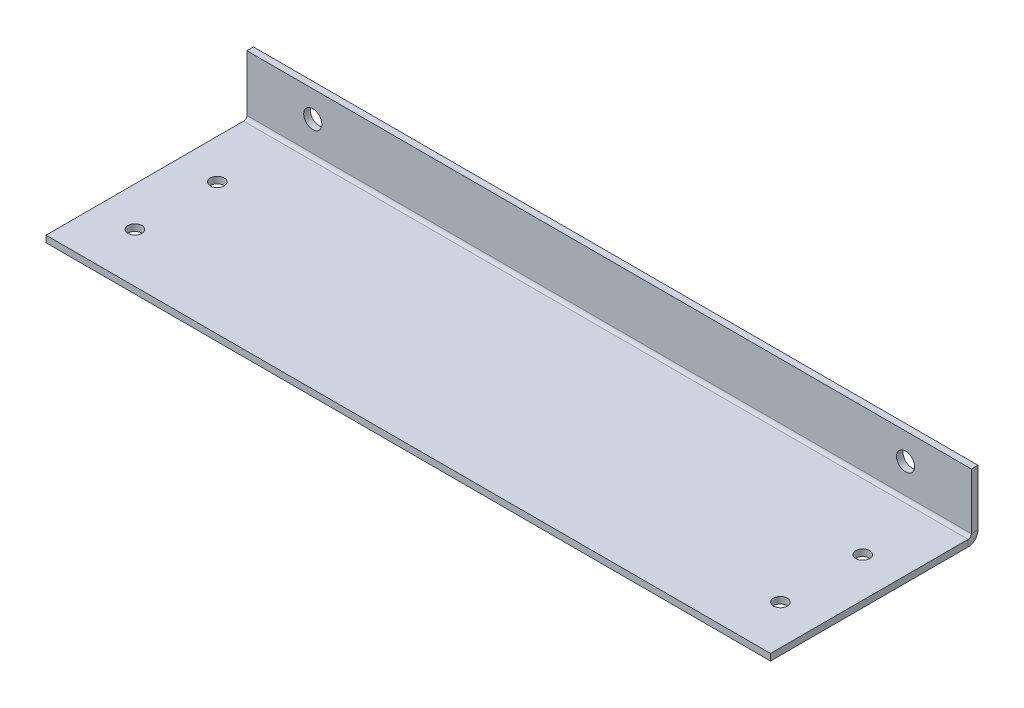
ISO-10303-21;
HEADER;
FILE_DESCRIPTION(('STEP AP214'),'2;1');
FILE_NAME('part.step','',(''),(''),'','','');
FILE_SCHEMA(('AUTOMOTIVE_DESIGN { 1 0 10303 214 1 1 1 1 }'));
ENDSEC;
DATA;
#1=APPLICATION_CONTEXT('core data for automotive mechanical design processes');
#2=APPLICATION_PROTOCOL_DEFINITION('international standard','automotive_design',2000,#1);
#3=PRODUCT_CONTEXT('',#1,'mechanical');
#4=PRODUCT('Part','Part','',(#3));
#5=PRODUCT_RELATED_PRODUCT_CATEGORY('part','',(#4));
#6=PRODUCT_DEFINITION_FORMATION('','',#4);
#7=PRODUCT_DEFINITION_CONTEXT('part definition',#1,'design');
#8=PRODUCT_DEFINITION('design','',#6,#7);
#9=PRODUCT_DEFINITION_SHAPE('','',#8);
#10=(LENGTH_UNIT() NAMED_UNIT(*) SI_UNIT(.MILLI.,.METRE.));
#11=(NAMED_UNIT(*) PLANE_ANGLE_UNIT() SI_UNIT($,.RADIAN.));
#12=(NAMED_UNIT(*) SI_UNIT($,.STERADIAN.) SOLID_ANGLE_UNIT());
#13=UNCERTAINTY_MEASURE_WITH_UNIT(LENGTH_MEASURE(1.E-05),#10,'distance_accuracy_value','');
#14=(GEOMETRIC_REPRESENTATION_CONTEXT(3) GLOBAL_UNCERTAINTY_ASSIGNED_CONTEXT((#13)) GLOBAL_UNIT_ASSIGNED_CONTEXT((#10,
#11,#12)) REPRESENTATION_CONTEXT('',''));
#15=CARTESIAN_POINT('',(0.,0.,0.));
#16=DIRECTION('',(0.,0.,1.));
#17=DIRECTION('',(1.,0.,0.));
#18=AXIS2_PLACEMENT_3D('',#15,#16,#17);
#19=CARTESIAN_POINT('',(-110.,-2.,-60.));
#20=DIRECTION('',(-1.,0.,0.));
#21=DIRECTION('',(0.,0.,1.));
#22=AXIS2_PLACEMENT_3D('',#19,#20,#21);
#23=PLANE('',#22);
#24=DIRECTION('',(0.,0.,1.));
#25=VECTOR('',#24,1.);
#26=CARTESIAN_POINT('',(-110.,0.,-60.));
#27=LINE('',#26,#25);
#28=CARTESIAN_POINT('',(-110.,0.,-60.));
#29=VERTEX_POINT('',#28);
#30=CARTESIAN_POINT('',(-110.,0.,0.));
#31=VERTEX_POINT('',#30);
#32=EDGE_CURVE('E101',#29,#31,#27,.T.);
#33=ORIENTED_EDGE('',*,*,#32,.F.);
#34=DIRECTION('',(0.,1.,0.));
#35=VECTOR('',#34,1.);
#36=CARTESIAN_POINT('',(-110.,-2.,-60.));
#37=LINE('',#36,#35);
#38=CARTESIAN_POINT('',(-110.,-2.00000000000004,-60.));
#39=VERTEX_POINT('',#38);
#40=EDGE_CURVE('E13',#39,#29,#37,.T.);
#41=ORIENTED_EDGE('',*,*,#40,.F.);
#42=DIRECTION('',(0.,0.,1.));
#43=VECTOR('',#42,1.);
#44=CARTESIAN_POINT('',(-110.,-2.,-60.));
#45=LINE('',#44,#43);
#46=CARTESIAN_POINT('',(-110.,-2.,0.));
#47=VERTEX_POINT('',#46);
#48=EDGE_CURVE('E206',#39,#47,#45,.T.);
#49=ORIENTED_EDGE('',*,*,#48,.T.);
#50=DIRECTION('',(0.,1.,0.));
#51=VECTOR('',#50,1.);
#52=CARTESIAN_POINT('',(-110.,-2.,0.));
#53=LINE('',#52,#51);
#54=EDGE_CURVE('E65',#47,#31,#53,.T.);
#55=ORIENTED_EDGE('',*,*,#54,.T.);
#56=EDGE_LOOP('',(#33,#41,#49,#55));
#57=FACE_BOUND('',#56,.T.);
#58=ADVANCED_FACE('F62',(#57),#23,.T.);
#59=CARTESIAN_POINT('',(110.,-2.,-60.));
#60=DIRECTION('',(1.,0.,0.));
#61=DIRECTION('',(0.,0.,-1.));
#62=AXIS2_PLACEMENT_3D('',#59,#60,#61);
#63=PLANE('',#62);
#64=DIRECTION('',(0.,0.,-1.));
#65=VECTOR('',#64,1.);
#66=CARTESIAN_POINT('',(110.,0.,-60.));
#67=LINE('',#66,#65);
#68=CARTESIAN_POINT('',(110.,0.,0.));
#69=VERTEX_POINT('',#68);
#70=CARTESIAN_POINT('',(110.,0.,-60.));
#71=VERTEX_POINT('',#70);
#72=EDGE_CURVE('E226',#69,#71,#67,.T.);
#73=ORIENTED_EDGE('',*,*,#72,.F.);
#74=DIRECTION('',(0.,1.,0.));
#75=VECTOR('',#74,1.);
#76=CARTESIAN_POINT('',(110.,-2.,0.));
#77=LINE('',#76,#75);
#78=CARTESIAN_POINT('',(110.,-2.,0.));
#79=VERTEX_POINT('',#78);
#80=EDGE_CURVE('E232',#79,#69,#77,.T.);
#81=ORIENTED_EDGE('',*,*,#80,.F.);
#82=DIRECTION('',(0.,0.,-1.));
#83=VECTOR('',#82,1.);
#84=CARTESIAN_POINT('',(110.,-2.,-60.));
#85=LINE('',#84,#83);
#86=CARTESIAN_POINT('',(110.,-2.,-60.));
#87=VERTEX_POINT('',#86);
#88=EDGE_CURVE('E81',#79,#87,#85,.T.);
#89=ORIENTED_EDGE('',*,*,#88,.T.);
#90=DIRECTION('',(0.,1.,0.));
#91=VECTOR('',#90,1.);
#92=CARTESIAN_POINT('',(110.,-2.,-60.));
#93=LINE('',#92,#91);
#94=EDGE_CURVE('E72',#87,#71,#93,.T.);
#95=ORIENTED_EDGE('',*,*,#94,.T.);
#96=EDGE_LOOP('',(#73,#81,#89,#95));
#97=FACE_BOUND('',#96,.T.);
#98=ADVANCED_FACE('F343',(#97),#63,.T.);
#99=CARTESIAN_POINT('',(-110.,-2.,0.));
#100=DIRECTION('',(0.,0.,1.));
#101=DIRECTION('',(1.,0.,0.));
#102=AXIS2_PLACEMENT_3D('',#99,#100,#101);
#103=PLANE('',#102);
#104=DIRECTION('',(1.,0.,0.));
#105=VECTOR('',#104,1.);
#106=CARTESIAN_POINT('',(-110.,0.,0.));
#107=LINE('',#106,#105);
#108=EDGE_CURVE('E222',#31,#69,#107,.T.);
#109=ORIENTED_EDGE('',*,*,#108,.F.);
#110=ORIENTED_EDGE('',*,*,#54,.F.);
#111=DIRECTION('',(1.,0.,0.));
#112=VECTOR('',#111,1.);
#113=CARTESIAN_POINT('',(-110.,-2.,0.));
#114=LINE('',#113,#112);
#115=EDGE_CURVE('E210',#47,#79,#114,.T.);
#116=ORIENTED_EDGE('',*,*,#115,.T.);
#117=ORIENTED_EDGE('',*,*,#80,.T.);
#118=EDGE_LOOP('',(#109,#110,#116,#117));
#119=FACE_BOUND('',#118,.T.);
#120=ADVANCED_FACE('F235',(#119),#103,.T.);
#121=CARTESIAN_POINT('',(0.,-2.,0.));
#122=DIRECTION('',(0.,1.,0.));
#123=DIRECTION('',(0.,0.,1.));
#124=AXIS2_PLACEMENT_3D('',#121,#122,#123);
#125=PLANE('',#124);
#126=CARTESIAN_POINT('',(98.,-2.,-40.));
#127=DIRECTION('',(0.,1.,0.));
#128=DIRECTION('',(0.,0.,1.));
#129=AXIS2_PLACEMENT_3D('',#126,#127,#128);
#130=CIRCLE('',#129,2.1);
#131=CARTESIAN_POINT('',(98.,-2.,-37.9));
#132=VERTEX_POINT('',#131);
#133=EDGE_CURVE('E294',#132,#132,#130,.T.);
#134=ORIENTED_EDGE('',*,*,#133,.T.);
#135=EDGE_LOOP('',(#134));
#136=FACE_BOUND('',#135,.T.);
#137=CARTESIAN_POINT('',(98.,-2.,-15.));
#138=DIRECTION('',(0.,1.,0.));
#139=DIRECTION('',(0.,0.,1.));
#140=AXIS2_PLACEMENT_3D('',#137,#138,#139);
#141=CIRCLE('',#140,2.1);
#142=CARTESIAN_POINT('',(98.,-2.,-12.9));
#143=VERTEX_POINT('',#142);
#144=EDGE_CURVE('E286',#143,#143,#141,.T.);
#145=ORIENTED_EDGE('',*,*,#144,.T.);
#146=EDGE_LOOP('',(#145));
#147=FACE_BOUND('',#146,.T.);
#148=CARTESIAN_POINT('',(-98.,-2.,-40.));
#149=DIRECTION('',(0.,1.,0.));
#150=DIRECTION('',(0.,0.,1.));
#151=AXIS2_PLACEMENT_3D('',#148,#149,#150);
#152=CIRCLE('',#151,2.1);
#153=CARTESIAN_POINT('',(-98.,-2.,-37.9));
#154=VERTEX_POINT('',#153);
#155=EDGE_CURVE('E278',#154,#154,#152,.T.);
#156=ORIENTED_EDGE('',*,*,#155,.T.);
#157=EDGE_LOOP('',(#156));
#158=FACE_BOUND('',#157,.T.);
#159=CARTESIAN_POINT('',(-98.,-2.,-15.));
#160=DIRECTION('',(0.,1.,0.));
#161=DIRECTION('',(0.,0.,1.));
#162=AXIS2_PLACEMENT_3D('',#159,#160,#161);
#163=CIRCLE('',#162,2.1);
#164=CARTESIAN_POINT('',(-98.,-2.,-12.9));
#165=VERTEX_POINT('',#164);
#166=EDGE_CURVE('E270',#165,#165,#163,.T.);
#167=ORIENTED_EDGE('',*,*,#166,.T.);
#168=EDGE_LOOP('',(#167));
#169=FACE_BOUND('',#168,.T.);
#170=ORIENTED_EDGE('',*,*,#48,.F.);
#171=DIRECTION('',(-1.,0.,0.));
#172=VECTOR('',#171,1.);
#173=CARTESIAN_POINT('',(-110.,-2.,-60.));
#174=LINE('',#173,#172);
#175=EDGE_CURVE('E216',#87,#39,#174,.T.);
#176=ORIENTED_EDGE('',*,*,#175,.F.);
#177=ORIENTED_EDGE('',*,*,#88,.F.);
#178=ORIENTED_EDGE('',*,*,#115,.F.);
#179=EDGE_LOOP('',(#170,#176,#177,#178));
#180=FACE_BOUND('',#179,.T.);
#181=ADVANCED_FACE('F309',(#136,#147,#158,#169,#180),#125,.F.);
#182=CARTESIAN_POINT('',(0.,0.,0.));
#183=DIRECTION('',(0.,1.,0.));
#184=DIRECTION('',(0.,0.,1.));
#185=AXIS2_PLACEMENT_3D('',#182,#183,#184);
#186=PLANE('',#185);
#187=CARTESIAN_POINT('',(98.,0.,-40.));
#188=DIRECTION('',(0.,1.,0.));
#189=DIRECTION('',(0.,0.,1.));
#190=AXIS2_PLACEMENT_3D('',#187,#188,#189);
#191=CIRCLE('',#190,2.1);
#192=CARTESIAN_POINT('',(98.,0.,-37.9));
#193=VERTEX_POINT('',#192);
#194=EDGE_CURVE('E298',#193,#193,#191,.T.);
#195=ORIENTED_EDGE('',*,*,#194,.F.);
#196=EDGE_LOOP('',(#195));
#197=FACE_BOUND('',#196,.T.);
#198=CARTESIAN_POINT('',(98.,0.,-15.));
#199=DIRECTION('',(0.,1.,0.));
#200=DIRECTION('',(0.,0.,1.));
#201=AXIS2_PLACEMENT_3D('',#198,#199,#200);
#202=CIRCLE('',#201,2.1);
#203=CARTESIAN_POINT('',(98.,0.,-12.9));
#204=VERTEX_POINT('',#203);
#205=EDGE_CURVE('E290',#204,#204,#202,.T.);
#206=ORIENTED_EDGE('',*,*,#205,.F.);
#207=EDGE_LOOP('',(#206));
#208=FACE_BOUND('',#207,.T.);
#209=CARTESIAN_POINT('',(-98.,0.,-40.));
#210=DIRECTION('',(0.,1.,0.));
#211=DIRECTION('',(0.,0.,1.));
#212=AXIS2_PLACEMENT_3D('',#209,#210,#211);
#213=CIRCLE('',#212,2.1);
#214=CARTESIAN_POINT('',(-98.,0.,-37.9));
#215=VERTEX_POINT('',#214);
#216=EDGE_CURVE('E282',#215,#215,#213,.T.);
#217=ORIENTED_EDGE('',*,*,#216,.F.);
#218=EDGE_LOOP('',(#217));
#219=FACE_BOUND('',#218,.T.);
#220=CARTESIAN_POINT('',(-98.,0.,-15.));
#221=DIRECTION('',(0.,1.,0.));
#222=DIRECTION('',(0.,0.,1.));
#223=AXIS2_PLACEMENT_3D('',#220,#221,#222);
#224=CIRCLE('',#223,2.1);
#225=CARTESIAN_POINT('',(-98.,0.,-12.9));
#226=VERTEX_POINT('',#225);
#227=EDGE_CURVE('E274',#226,#226,#224,.T.);
#228=ORIENTED_EDGE('',*,*,#227,.F.);
#229=EDGE_LOOP('',(#228));
#230=FACE_BOUND('',#229,.T.);
#231=ORIENTED_EDGE('',*,*,#32,.T.);
#232=ORIENTED_EDGE('',*,*,#108,.T.);
#233=ORIENTED_EDGE('',*,*,#72,.T.);
#234=DIRECTION('',(-1.,0.,0.));
#235=VECTOR('',#234,1.);
#236=CARTESIAN_POINT('',(-110.,0.,-60.));
#237=LINE('',#236,#235);
#238=EDGE_CURVE('E211',#71,#29,#237,.T.);
#239=ORIENTED_EDGE('',*,*,#238,.T.);
#240=EDGE_LOOP('',(#231,#232,#233,#239));
#241=FACE_BOUND('',#240,.T.);
#242=ADVANCED_FACE('F237',(#197,#208,#219,#230,#241),#186,.T.);
#243=CARTESIAN_POINT('',(110.,0.999999999999984,-60.));
#244=DIRECTION('',(1.,0.,0.));
#245=DIRECTION('',(0.,0.,-1.));
#246=AXIS2_PLACEMENT_3D('',#243,#244,#245);
#247=PLANE('',#246);
#248=DIRECTION('',(0.,0.,1.));
#249=VECTOR('',#248,1.);
#250=CARTESIAN_POINT('',(110.,1.00000000000001,-63.));
#251=LINE('',#250,#249);
#252=CARTESIAN_POINT('',(110.,0.99999999999998,-61.));
#253=VERTEX_POINT('',#252);
#254=CARTESIAN_POINT('',(110.,0.999999999999973,-63.));
#255=VERTEX_POINT('',#254);
#256=EDGE_CURVE('E163',#253,#255,#251,.F.);
#257=ORIENTED_EDGE('',*,*,#256,.F.);
#258=CARTESIAN_POINT('',(110.,0.999999999999984,-60.));
#259=DIRECTION('',(-1.,0.,0.));
#260=DIRECTION('',(0.,0.,1.));
#261=AXIS2_PLACEMENT_3D('',#258,#259,#260);
#262=CIRCLE('',#261,1.00000000000002);
#263=EDGE_CURVE('E198',#71,#253,#262,.F.);
#264=ORIENTED_EDGE('',*,*,#263,.F.);
#265=ORIENTED_EDGE('',*,*,#94,.F.);
#266=CARTESIAN_POINT('',(110.,0.999999999999984,-60.));
#267=DIRECTION('',(-1.,0.,0.));
#268=DIRECTION('',(0.,0.,1.));
#269=AXIS2_PLACEMENT_3D('',#266,#267,#268);
#270=CIRCLE('',#269,3.00000000000002);
#271=EDGE_CURVE('E190',#87,#255,#270,.F.);
#272=ORIENTED_EDGE('',*,*,#271,.T.);
#273=EDGE_LOOP('',(#257,#264,#265,#272));
#274=FACE_BOUND('',#273,.T.);
#275=ADVANCED_FACE('F308',(#274),#247,.T.);
#276=CARTESIAN_POINT('',(-110.,0.999999999999984,-60.));
#277=DIRECTION('',(1.,0.,0.));
#278=DIRECTION('',(0.,0.,-1.));
#279=AXIS2_PLACEMENT_3D('',#276,#277,#278);
#280=PLANE('',#279);
#281=CARTESIAN_POINT('',(-110.,0.999999999999984,-60.));
#282=DIRECTION('',(-1.,0.,0.));
#283=DIRECTION('',(0.,0.,1.));
#284=AXIS2_PLACEMENT_3D('',#281,#282,#283);
#285=CIRCLE('',#284,1.00000000000002);
#286=CARTESIAN_POINT('',(-110.,0.99999999999998,-61.));
#287=VERTEX_POINT('',#286);
#288=EDGE_CURVE('E202',#287,#29,#285,.T.);
#289=ORIENTED_EDGE('',*,*,#288,.F.);
#290=DIRECTION('',(0.,0.,1.));
#291=VECTOR('',#290,1.);
#292=CARTESIAN_POINT('',(-110.,0.999999999999987,-61.));
#293=LINE('',#292,#291);
#294=CARTESIAN_POINT('',(-110.,1.,-63.));
#295=VERTEX_POINT('',#294);
#296=EDGE_CURVE('E180',#287,#295,#293,.F.);
#297=ORIENTED_EDGE('',*,*,#296,.T.);
#298=CARTESIAN_POINT('',(-110.,0.999999999999984,-60.));
#299=DIRECTION('',(-1.,0.,0.));
#300=DIRECTION('',(0.,0.,1.));
#301=AXIS2_PLACEMENT_3D('',#298,#299,#300);
#302=CIRCLE('',#301,3.00000000000002);
#303=EDGE_CURVE('E194',#295,#39,#302,.T.);
#304=ORIENTED_EDGE('',*,*,#303,.T.);
#305=ORIENTED_EDGE('',*,*,#40,.T.);
#306=EDGE_LOOP('',(#289,#297,#304,#305));
#307=FACE_BOUND('',#306,.T.);
#308=ADVANCED_FACE('F243',(#307),#280,.F.);
#309=CARTESIAN_POINT('',(-110.,0.999999999999984,-60.));
#310=DIRECTION('',(-1.,0.,0.));
#311=DIRECTION('',(0.,0.,-1.));
#312=AXIS2_PLACEMENT_3D('',#309,#310,#311);
#313=CYLINDRICAL_SURFACE('',#312,3.00000000000002);
#314=ORIENTED_EDGE('',*,*,#175,.T.);
#315=ORIENTED_EDGE('',*,*,#303,.F.);
#316=DIRECTION('',(-1.,0.,0.));
#317=VECTOR('',#316,1.);
#318=CARTESIAN_POINT('',(110.,1.00000000000001,-63.));
#319=LINE('',#318,#317);
#320=EDGE_CURVE('E177',#295,#255,#319,.F.);
#321=ORIENTED_EDGE('',*,*,#320,.T.);
#322=ORIENTED_EDGE('',*,*,#271,.F.);
#323=EDGE_LOOP('',(#314,#315,#321,#322));
#324=FACE_BOUND('',#323,.T.);
#325=ADVANCED_FACE('F332',(#324),#313,.T.);
#326=CARTESIAN_POINT('',(-110.,0.999999999999984,-60.));
#327=DIRECTION('',(-1.,0.,0.));
#328=DIRECTION('',(0.,0.,-1.));
#329=AXIS2_PLACEMENT_3D('',#326,#327,#328);
#330=CYLINDRICAL_SURFACE('',#329,1.00000000000002);
#331=ORIENTED_EDGE('',*,*,#238,.F.);
#332=ORIENTED_EDGE('',*,*,#263,.T.);
#333=DIRECTION('',(-1.,0.,0.));
#334=VECTOR('',#333,1.);
#335=CARTESIAN_POINT('',(110.,0.999999999999994,-61.));
#336=LINE('',#335,#334);
#337=EDGE_CURVE('E184',#253,#287,#336,.T.);
#338=ORIENTED_EDGE('',*,*,#337,.T.);
#339=ORIENTED_EDGE('',*,*,#288,.T.);
#340=EDGE_LOOP('',(#331,#332,#338,#339));
#341=FACE_BOUND('',#340,.T.);
#342=ADVANCED_FACE('F245',(#341),#330,.F.);
#343=CARTESIAN_POINT('',(110.,0.,-63.));
#344=DIRECTION('',(-1.,0.,0.));
#345=DIRECTION('',(0.,0.,1.));
#346=AXIS2_PLACEMENT_3D('',#343,#344,#345);
#347=PLANE('',#346);
#348=ORIENTED_EDGE('',*,*,#256,.T.);
#349=DIRECTION('',(0.,-1.,0.));
#350=VECTOR('',#349,1.);
#351=CARTESIAN_POINT('',(110.,-2.15149779794903E-13,-63.));
#352=LINE('',#351,#350);
#353=CARTESIAN_POINT('',(110.,18.,-63.0000000000001));
#354=VERTEX_POINT('',#353);
#355=EDGE_CURVE('E142',#354,#255,#352,.T.);
#356=ORIENTED_EDGE('',*,*,#355,.F.);
#357=DIRECTION('',(0.,0.,1.));
#358=VECTOR('',#357,1.);
#359=CARTESIAN_POINT('',(110.,18.,-63.0000000000001));
#360=LINE('',#359,#358);
#361=CARTESIAN_POINT('',(110.,18.,-61.0000000000001));
#362=VERTEX_POINT('',#361);
#363=EDGE_CURVE('E149',#354,#362,#360,.T.);
#364=ORIENTED_EDGE('',*,*,#363,.T.);
#365=DIRECTION('',(0.,1.,0.));
#366=VECTOR('',#365,1.);
#367=CARTESIAN_POINT('',(110.,0.,-61.));
#368=LINE('',#367,#366);
#369=EDGE_CURVE('E174',#362,#253,#368,.F.);
#370=ORIENTED_EDGE('',*,*,#369,.T.);
#371=EDGE_LOOP('',(#348,#356,#364,#370));
#372=FACE_BOUND('',#371,.T.);
#373=ADVANCED_FACE('F162',(#372),#347,.F.);
#374=CARTESIAN_POINT('',(-110.,18.,-63.0000000000001));
#375=DIRECTION('',(1.,0.,0.));
#376=DIRECTION('',(0.,0.,-1.));
#377=AXIS2_PLACEMENT_3D('',#374,#375,#376);
#378=PLANE('',#377);
#379=ORIENTED_EDGE('',*,*,#296,.F.);
#380=DIRECTION('',(0.,-1.,0.));
#381=VECTOR('',#380,1.);
#382=CARTESIAN_POINT('',(-110.,18.,-61.0000000000001));
#383=LINE('',#382,#381);
#384=CARTESIAN_POINT('',(-110.,18.,-61.0000000000001));
#385=VERTEX_POINT('',#384);
#386=EDGE_CURVE('E169',#287,#385,#383,.F.);
#387=ORIENTED_EDGE('',*,*,#386,.T.);
#388=DIRECTION('',(0.,0.,1.));
#389=VECTOR('',#388,1.);
#390=CARTESIAN_POINT('',(-110.,18.,-63.0000000000001));
#391=LINE('',#390,#389);
#392=CARTESIAN_POINT('',(-110.,18.,-63.0000000000001));
#393=VERTEX_POINT('',#392);
#394=EDGE_CURVE('E159',#393,#385,#391,.T.);
#395=ORIENTED_EDGE('',*,*,#394,.F.);
#396=DIRECTION('',(0.,1.,0.));
#397=VECTOR('',#396,1.);
#398=CARTESIAN_POINT('',(-110.,-2.15149779794903E-13,-63.));
#399=LINE('',#398,#397);
#400=EDGE_CURVE('E144',#295,#393,#399,.T.);
#401=ORIENTED_EDGE('',*,*,#400,.F.);
#402=EDGE_LOOP('',(#379,#387,#395,#401));
#403=FACE_BOUND('',#402,.T.);
#404=ADVANCED_FACE('F251',(#403),#378,.F.);
#405=CARTESIAN_POINT('',(0.,-2.15149779794903E-13,-63.));
#406=DIRECTION('',(0.,0.,1.));
#407=DIRECTION('',(0.,-1.,0.));
#408=AXIS2_PLACEMENT_3D('',#405,#406,#407);
#409=PLANE('',#408);
#410=CARTESIAN_POINT('',(90.,10.,-63.0000000000001));
#411=DIRECTION('',(0.,0.,1.));
#412=DIRECTION('',(0.,-1.,0.));
#413=AXIS2_PLACEMENT_3D('',#410,#411,#412);
#414=CIRCLE('',#413,2.75);
#415=CARTESIAN_POINT('',(90.,7.25,-63.0000000000001));
#416=VERTEX_POINT('',#415);
#417=EDGE_CURVE('E262',#416,#416,#414,.T.);
#418=ORIENTED_EDGE('',*,*,#417,.T.);
#419=EDGE_LOOP('',(#418));
#420=FACE_BOUND('',#419,.T.);
#421=CARTESIAN_POINT('',(-90.,10.,-63.));
#422=DIRECTION('',(0.,0.,1.));
#423=DIRECTION('',(0.,-1.,0.));
#424=AXIS2_PLACEMENT_3D('',#421,#422,#423);
#425=CIRCLE('',#424,2.75);
#426=CARTESIAN_POINT('',(-90.,7.25,-63.));
#427=VERTEX_POINT('',#426);
#428=EDGE_CURVE('E189',#427,#427,#425,.T.);
#429=ORIENTED_EDGE('',*,*,#428,.T.);
#430=EDGE_LOOP('',(#429));
#431=FACE_BOUND('',#430,.T.);
#432=ORIENTED_EDGE('',*,*,#320,.F.);
#433=ORIENTED_EDGE('',*,*,#400,.T.);
#434=DIRECTION('',(1.,0.,0.));
#435=VECTOR('',#434,1.);
#436=CARTESIAN_POINT('',(0.,18.,-63.0000000000001));
#437=LINE('',#436,#435);
#438=EDGE_CURVE('E137',#393,#354,#437,.T.);
#439=ORIENTED_EDGE('',*,*,#438,.T.);
#440=ORIENTED_EDGE('',*,*,#355,.T.);
#441=EDGE_LOOP('',(#432,#433,#439,#440));
#442=FACE_BOUND('',#441,.T.);
#443=ADVANCED_FACE('F140',(#420,#431,#442),#409,.F.);
#444=CARTESIAN_POINT('',(0.,-2.08166817117217E-13,-61.));
#445=DIRECTION('',(0.,0.,1.));
#446=DIRECTION('',(0.,-1.,0.));
#447=AXIS2_PLACEMENT_3D('',#444,#445,#446);
#448=PLANE('',#447);
#449=CARTESIAN_POINT('',(90.,10.,-61.));
#450=DIRECTION('',(0.,0.,1.));
#451=DIRECTION('',(0.,-1.,0.));
#452=AXIS2_PLACEMENT_3D('',#449,#450,#451);
#453=CIRCLE('',#452,2.75);
#454=CARTESIAN_POINT('',(90.,7.25000000000001,-61.));
#455=VERTEX_POINT('',#454);
#456=EDGE_CURVE('E266',#455,#455,#453,.T.);
#457=ORIENTED_EDGE('',*,*,#456,.F.);
#458=EDGE_LOOP('',(#457));
#459=FACE_BOUND('',#458,.T.);
#460=CARTESIAN_POINT('',(-90.,10.,-61.));
#461=DIRECTION('',(0.,0.,1.));
#462=DIRECTION('',(0.,-1.,0.));
#463=AXIS2_PLACEMENT_3D('',#460,#461,#462);
#464=CIRCLE('',#463,2.75);
#465=CARTESIAN_POINT('',(-90.,7.25000000000001,-61.));
#466=VERTEX_POINT('',#465);
#467=EDGE_CURVE('E258',#466,#466,#464,.T.);
#468=ORIENTED_EDGE('',*,*,#467,.F.);
#469=EDGE_LOOP('',(#468));
#470=FACE_BOUND('',#469,.T.);
#471=ORIENTED_EDGE('',*,*,#386,.F.);
#472=ORIENTED_EDGE('',*,*,#337,.F.);
#473=ORIENTED_EDGE('',*,*,#369,.F.);
#474=DIRECTION('',(-1.,0.,0.));
#475=VECTOR('',#474,1.);
#476=CARTESIAN_POINT('',(110.,18.,-61.0000000000001));
#477=LINE('',#476,#475);
#478=EDGE_CURVE('E154',#385,#362,#477,.F.);
#479=ORIENTED_EDGE('',*,*,#478,.F.);
#480=EDGE_LOOP('',(#471,#472,#473,#479));
#481=FACE_BOUND('',#480,.T.);
#482=ADVANCED_FACE('F249',(#459,#470,#481),#448,.T.);
#483=CARTESIAN_POINT('',(110.,18.,-63.0000000000001));
#484=DIRECTION('',(0.,-1.,0.));
#485=DIRECTION('',(0.,0.,-1.));
#486=AXIS2_PLACEMENT_3D('',#483,#484,#485);
#487=PLANE('',#486);
#488=ORIENTED_EDGE('',*,*,#478,.T.);
#489=ORIENTED_EDGE('',*,*,#363,.F.);
#490=ORIENTED_EDGE('',*,*,#438,.F.);
#491=ORIENTED_EDGE('',*,*,#394,.T.);
#492=EDGE_LOOP('',(#488,#489,#490,#491));
#493=FACE_BOUND('',#492,.T.);
#494=ADVANCED_FACE('F152',(#493),#487,.F.);
#495=CARTESIAN_POINT('',(-90.,10.,-61.));
#496=DIRECTION('',(0.,0.,1.));
#497=DIRECTION('',(0.,-1.,0.));
#498=AXIS2_PLACEMENT_3D('',#495,#496,#497);
#499=CYLINDRICAL_SURFACE('',#498,2.75);
#500=ORIENTED_EDGE('',*,*,#467,.T.);
#501=EDGE_LOOP('',(#500));
#502=FACE_BOUND('',#501,.T.);
#503=ORIENTED_EDGE('',*,*,#428,.F.);
#504=EDGE_LOOP('',(#503));
#505=FACE_BOUND('',#504,.T.);
#506=ADVANCED_FACE('F405',(#502,#505),#499,.F.);
#507=CARTESIAN_POINT('',(90.,10.,-61.));
#508=DIRECTION('',(0.,0.,1.));
#509=DIRECTION('',(0.,-1.,0.));
#510=AXIS2_PLACEMENT_3D('',#507,#508,#509);
#511=CYLINDRICAL_SURFACE('',#510,2.75);
#512=ORIENTED_EDGE('',*,*,#456,.T.);
#513=EDGE_LOOP('',(#512));
#514=FACE_BOUND('',#513,.T.);
#515=ORIENTED_EDGE('',*,*,#417,.F.);
#516=EDGE_LOOP('',(#515));
#517=FACE_BOUND('',#516,.T.);
#518=ADVANCED_FACE('F321',(#514,#517),#511,.F.);
#519=CARTESIAN_POINT('',(-98.,0.,-15.));
#520=DIRECTION('',(0.,1.,0.));
#521=DIRECTION('',(0.,0.,1.));
#522=AXIS2_PLACEMENT_3D('',#519,#520,#521);
#523=CYLINDRICAL_SURFACE('',#522,2.1);
#524=ORIENTED_EDGE('',*,*,#227,.T.);
#525=EDGE_LOOP('',(#524));
#526=FACE_BOUND('',#525,.T.);
#527=ORIENTED_EDGE('',*,*,#166,.F.);
#528=EDGE_LOOP('',(#527));
#529=FACE_BOUND('',#528,.T.);
#530=ADVANCED_FACE('F317',(#526,#529),#523,.F.);
#531=CARTESIAN_POINT('',(-98.,0.,-40.));
#532=DIRECTION('',(0.,1.,0.));
#533=DIRECTION('',(0.,0.,1.));
#534=AXIS2_PLACEMENT_3D('',#531,#532,#533);
#535=CYLINDRICAL_SURFACE('',#534,2.1);
#536=ORIENTED_EDGE('',*,*,#216,.T.);
#537=EDGE_LOOP('',(#536));
#538=FACE_BOUND('',#537,.T.);
#539=ORIENTED_EDGE('',*,*,#155,.F.);
#540=EDGE_LOOP('',(#539));
#541=FACE_BOUND('',#540,.T.);
#542=ADVANCED_FACE('F320',(#538,#541),#535,.F.);
#543=CARTESIAN_POINT('',(98.,0.,-15.));
#544=DIRECTION('',(0.,1.,0.));
#545=DIRECTION('',(0.,0.,1.));
#546=AXIS2_PLACEMENT_3D('',#543,#544,#545);
#547=CYLINDRICAL_SURFACE('',#546,2.1);
#548=ORIENTED_EDGE('',*,*,#205,.T.);
#549=EDGE_LOOP('',(#548));
#550=FACE_BOUND('',#549,.T.);
#551=ORIENTED_EDGE('',*,*,#144,.F.);
#552=EDGE_LOOP('',(#551));
#553=FACE_BOUND('',#552,.T.);
#554=ADVANCED_FACE('F466',(#550,#553),#547,.F.);
#555=CARTESIAN_POINT('',(98.,0.,-40.));
#556=DIRECTION('',(0.,1.,0.));
#557=DIRECTION('',(0.,0.,1.));
#558=AXIS2_PLACEMENT_3D('',#555,#556,#557);
#559=CYLINDRICAL_SURFACE('',#558,2.1);
#560=ORIENTED_EDGE('',*,*,#194,.T.);
#561=EDGE_LOOP('',(#560));
#562=FACE_BOUND('',#561,.T.);
#563=ORIENTED_EDGE('',*,*,#133,.F.);
#564=EDGE_LOOP('',(#563));
#565=FACE_BOUND('',#564,.T.);
#566=ADVANCED_FACE('F303',(#562,#565),#559,.F.);
#567=CLOSED_SHELL('',(#58,#98,#120,#181,#242,#275,#308,#325,#342,#373,#404,#443,#482,#494,#506,
#518,#530,#542,#554,#566));
#568=MANIFOLD_SOLID_BREP('B2',#567);
#569=ADVANCED_BREP_SHAPE_REPRESENTATION('',(#18,#568),#14);
#570=SHAPE_DEFINITION_REPRESENTATION(#9,#569);
ENDSEC;
END-ISO-10303-21;
